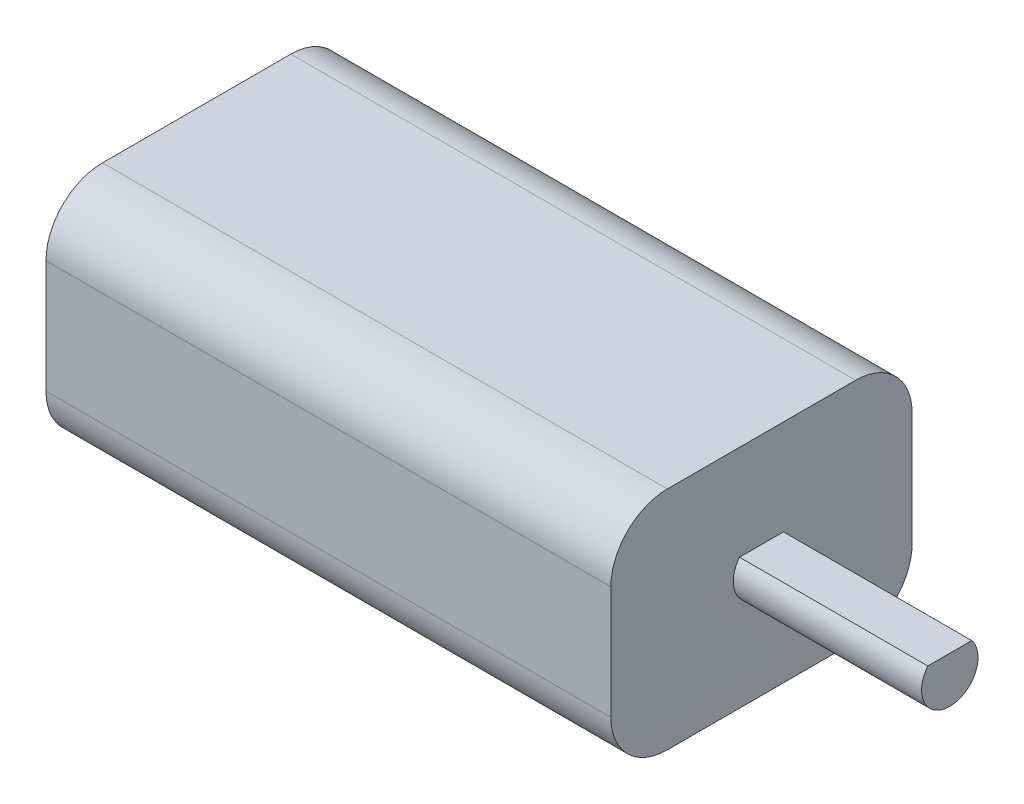
ISO-10303-21;
HEADER;
FILE_DESCRIPTION(('STEP AP214'),'2;1');
FILE_NAME('part.step','',(''),(''),'','','');
FILE_SCHEMA(('AUTOMOTIVE_DESIGN { 1 0 10303 214 1 1 1 1 }'));
ENDSEC;
DATA;
#1=APPLICATION_CONTEXT('core data for automotive mechanical design processes');
#2=APPLICATION_PROTOCOL_DEFINITION('international standard','automotive_design',2000,#1);
#3=PRODUCT_CONTEXT('',#1,'mechanical');
#4=PRODUCT('Part','Part','',(#3));
#5=PRODUCT_RELATED_PRODUCT_CATEGORY('part','',(#4));
#6=PRODUCT_DEFINITION_FORMATION('','',#4);
#7=PRODUCT_DEFINITION_CONTEXT('part definition',#1,'design');
#8=PRODUCT_DEFINITION('design','',#6,#7);
#9=PRODUCT_DEFINITION_SHAPE('','',#8);
#10=(LENGTH_UNIT() NAMED_UNIT(*) SI_UNIT(.MILLI.,.METRE.));
#11=(NAMED_UNIT(*) PLANE_ANGLE_UNIT() SI_UNIT($,.RADIAN.));
#12=(NAMED_UNIT(*) SI_UNIT($,.STERADIAN.) SOLID_ANGLE_UNIT());
#13=UNCERTAINTY_MEASURE_WITH_UNIT(LENGTH_MEASURE(1.E-05),#10,'distance_accuracy_value','');
#14=(GEOMETRIC_REPRESENTATION_CONTEXT(3) GLOBAL_UNCERTAINTY_ASSIGNED_CONTEXT((#13)) GLOBAL_UNIT_ASSIGNED_CONTEXT((#10,
#11,#12)) REPRESENTATION_CONTEXT('',''));
#15=CARTESIAN_POINT('',(0.,0.,0.));
#16=DIRECTION('',(0.,0.,1.));
#17=DIRECTION('',(1.,0.,0.));
#18=AXIS2_PLACEMENT_3D('',#15,#16,#17);
#19=CARTESIAN_POINT('',(15.,12.,8.));
#20=DIRECTION('',(-1.,0.,0.));
#21=DIRECTION('',(0.,0.,1.));
#22=AXIS2_PLACEMENT_3D('',#19,#20,#21);
#23=PLANE('',#22);
#24=DIRECTION('',(0.,-1.,0.));
#25=VECTOR('',#24,1.);
#26=CARTESIAN_POINT('',(15.,12.,8.));
#27=LINE('',#26,#25);
#28=CARTESIAN_POINT('',(15.,9.,8.));
#29=VERTEX_POINT('',#28);
#30=CARTESIAN_POINT('',(15.,3.,8.));
#31=VERTEX_POINT('',#30);
#32=EDGE_CURVE('E139',#29,#31,#27,.T.);
#33=ORIENTED_EDGE('',*,*,#32,.T.);
#34=CARTESIAN_POINT('',(15.,3.,5.));
#35=DIRECTION('',(-1.,0.,0.));
#36=DIRECTION('',(0.,0.,1.));
#37=AXIS2_PLACEMENT_3D('',#34,#35,#36);
#38=CIRCLE('',#37,3.);
#39=CARTESIAN_POINT('',(15.,0.,5.));
#40=VERTEX_POINT('',#39);
#41=EDGE_CURVE('E165',#31,#40,#38,.F.);
#42=ORIENTED_EDGE('',*,*,#41,.T.);
#43=DIRECTION('',(0.,0.,-1.));
#44=VECTOR('',#43,1.);
#45=CARTESIAN_POINT('',(15.,0.,8.));
#46=LINE('',#45,#44);
#47=CARTESIAN_POINT('',(15.,0.,-5.));
#48=VERTEX_POINT('',#47);
#49=EDGE_CURVE('E126',#40,#48,#46,.T.);
#50=ORIENTED_EDGE('',*,*,#49,.T.);
#51=CARTESIAN_POINT('',(15.,3.,-5.));
#52=DIRECTION('',(-1.,0.,0.));
#53=DIRECTION('',(0.,0.,1.));
#54=AXIS2_PLACEMENT_3D('',#51,#52,#53);
#55=CIRCLE('',#54,3.);
#56=CARTESIAN_POINT('',(15.,3.,-8.));
#57=VERTEX_POINT('',#56);
#58=EDGE_CURVE('E159',#48,#57,#55,.F.);
#59=ORIENTED_EDGE('',*,*,#58,.T.);
#60=DIRECTION('',(0.,-1.,0.));
#61=VECTOR('',#60,1.);
#62=CARTESIAN_POINT('',(15.,12.,-8.));
#63=LINE('',#62,#61);
#64=CARTESIAN_POINT('',(15.,9.,-8.));
#65=VERTEX_POINT('',#64);
#66=EDGE_CURVE('E151',#65,#57,#63,.T.);
#67=ORIENTED_EDGE('',*,*,#66,.F.);
#68=CARTESIAN_POINT('',(15.,9.,-5.));
#69=DIRECTION('',(-1.,0.,0.));
#70=DIRECTION('',(0.,0.,1.));
#71=AXIS2_PLACEMENT_3D('',#68,#69,#70);
#72=CIRCLE('',#71,3.);
#73=CARTESIAN_POINT('',(15.,12.,-5.));
#74=VERTEX_POINT('',#73);
#75=EDGE_CURVE('E161',#65,#74,#72,.F.);
#76=ORIENTED_EDGE('',*,*,#75,.T.);
#77=DIRECTION('',(0.,0.,-1.));
#78=VECTOR('',#77,1.);
#79=CARTESIAN_POINT('',(15.,12.,8.));
#80=LINE('',#79,#78);
#81=CARTESIAN_POINT('',(15.,12.,5.));
#82=VERTEX_POINT('',#81);
#83=EDGE_CURVE('E134',#82,#74,#80,.T.);
#84=ORIENTED_EDGE('',*,*,#83,.F.);
#85=CARTESIAN_POINT('',(15.,9.,5.));
#86=DIRECTION('',(-1.,0.,0.));
#87=DIRECTION('',(0.,0.,1.));
#88=AXIS2_PLACEMENT_3D('',#85,#86,#87);
#89=CIRCLE('',#88,3.);
#90=EDGE_CURVE('E163',#82,#29,#89,.F.);
#91=ORIENTED_EDGE('',*,*,#90,.T.);
#92=EDGE_LOOP('',(#33,#42,#50,#59,#67,#76,#84,#91));
#93=FACE_BOUND('',#92,.T.);
#94=CARTESIAN_POINT('',(15.,6.,0.));
#95=DIRECTION('',(1.,0.,0.));
#96=DIRECTION('',(0.,0.,-1.));
#97=AXIS2_PLACEMENT_3D('',#94,#95,#96);
#98=CIRCLE('',#97,1.5);
#99=CARTESIAN_POINT('',(15.,6.94293461893889,1.16656517366436));
#100=VERTEX_POINT('',#99);
#101=CARTESIAN_POINT('',(15.,6.94293461893889,-1.16656517366437));
#102=VERTEX_POINT('',#101);
#103=EDGE_CURVE('E125',#100,#102,#98,.T.);
#104=ORIENTED_EDGE('',*,*,#103,.F.);
#105=DIRECTION('',(0.,0.,1.));
#106=VECTOR('',#105,1.);
#107=CARTESIAN_POINT('',(15.,6.94293461893889,1.16656517366436));
#108=LINE('',#107,#106);
#109=EDGE_CURVE('E47',#102,#100,#108,.T.);
#110=ORIENTED_EDGE('',*,*,#109,.F.);
#111=EDGE_LOOP('',(#104,#110));
#112=FACE_BOUND('',#111,.T.);
#113=ADVANCED_FACE('F33',(#93,#112),#23,.F.);
#114=CARTESIAN_POINT('',(-15.,12.,-8.));
#115=DIRECTION('',(0.,0.,1.));
#116=DIRECTION('',(1.,0.,0.));
#117=AXIS2_PLACEMENT_3D('',#114,#115,#116);
#118=PLANE('',#117);
#119=DIRECTION('',(0.,-1.,0.));
#120=VECTOR('',#119,1.);
#121=CARTESIAN_POINT('',(-15.,12.,-8.));
#122=LINE('',#121,#120);
#123=CARTESIAN_POINT('',(-15.,9.,-8.));
#124=VERTEX_POINT('',#123);
#125=CARTESIAN_POINT('',(-15.,3.,-8.));
#126=VERTEX_POINT('',#125);
#127=EDGE_CURVE('E148',#124,#126,#122,.T.);
#128=ORIENTED_EDGE('',*,*,#127,.F.);
#129=DIRECTION('',(-1.,0.,0.));
#130=VECTOR('',#129,1.);
#131=CARTESIAN_POINT('',(-15.,9.,-8.));
#132=LINE('',#131,#130);
#133=EDGE_CURVE('E11',#124,#65,#132,.F.);
#134=ORIENTED_EDGE('',*,*,#133,.T.);
#135=ORIENTED_EDGE('',*,*,#66,.T.);
#136=DIRECTION('',(-1.,0.,0.));
#137=VECTOR('',#136,1.);
#138=CARTESIAN_POINT('',(-15.,3.,-8.));
#139=LINE('',#138,#137);
#140=EDGE_CURVE('E41',#57,#126,#139,.T.);
#141=ORIENTED_EDGE('',*,*,#140,.T.);
#142=EDGE_LOOP('',(#128,#134,#135,#141));
#143=FACE_BOUND('',#142,.T.);
#144=ADVANCED_FACE('F185',(#143),#118,.F.);
#145=CARTESIAN_POINT('',(-15.,12.,8.));
#146=DIRECTION('',(1.,0.,0.));
#147=DIRECTION('',(0.,0.,-1.));
#148=AXIS2_PLACEMENT_3D('',#145,#146,#147);
#149=PLANE('',#148);
#150=DIRECTION('',(0.,0.,1.));
#151=VECTOR('',#150,1.);
#152=CARTESIAN_POINT('',(-15.,0.,8.));
#153=LINE('',#152,#151);
#154=CARTESIAN_POINT('',(-15.,0.,-5.));
#155=VERTEX_POINT('',#154);
#156=CARTESIAN_POINT('',(-15.,0.,5.));
#157=VERTEX_POINT('',#156);
#158=EDGE_CURVE('E129',#155,#157,#153,.T.);
#159=ORIENTED_EDGE('',*,*,#158,.T.);
#160=CARTESIAN_POINT('',(-15.,3.,5.));
#161=DIRECTION('',(1.,0.,0.));
#162=DIRECTION('',(0.,0.,-1.));
#163=AXIS2_PLACEMENT_3D('',#160,#161,#162);
#164=CIRCLE('',#163,3.);
#165=CARTESIAN_POINT('',(-15.,3.,8.));
#166=VERTEX_POINT('',#165);
#167=EDGE_CURVE('E176',#157,#166,#164,.F.);
#168=ORIENTED_EDGE('',*,*,#167,.T.);
#169=DIRECTION('',(0.,-1.,0.));
#170=VECTOR('',#169,1.);
#171=CARTESIAN_POINT('',(-15.,12.,8.));
#172=LINE('',#171,#170);
#173=CARTESIAN_POINT('',(-15.,9.,8.));
#174=VERTEX_POINT('',#173);
#175=EDGE_CURVE('E145',#174,#166,#172,.T.);
#176=ORIENTED_EDGE('',*,*,#175,.F.);
#177=CARTESIAN_POINT('',(-15.,9.,5.));
#178=DIRECTION('',(1.,0.,0.));
#179=DIRECTION('',(0.,0.,-1.));
#180=AXIS2_PLACEMENT_3D('',#177,#178,#179);
#181=CIRCLE('',#180,3.);
#182=CARTESIAN_POINT('',(-15.,12.,5.));
#183=VERTEX_POINT('',#182);
#184=EDGE_CURVE('E174',#174,#183,#181,.F.);
#185=ORIENTED_EDGE('',*,*,#184,.T.);
#186=DIRECTION('',(0.,0.,1.));
#187=VECTOR('',#186,1.);
#188=CARTESIAN_POINT('',(-15.,12.,8.));
#189=LINE('',#188,#187);
#190=CARTESIAN_POINT('',(-15.,12.,-5.));
#191=VERTEX_POINT('',#190);
#192=EDGE_CURVE('E137',#191,#183,#189,.T.);
#193=ORIENTED_EDGE('',*,*,#192,.F.);
#194=CARTESIAN_POINT('',(-15.,9.,-5.));
#195=DIRECTION('',(1.,0.,0.));
#196=DIRECTION('',(0.,0.,-1.));
#197=AXIS2_PLACEMENT_3D('',#194,#195,#196);
#198=CIRCLE('',#197,3.);
#199=EDGE_CURVE('E172',#191,#124,#198,.F.);
#200=ORIENTED_EDGE('',*,*,#199,.T.);
#201=ORIENTED_EDGE('',*,*,#127,.T.);
#202=CARTESIAN_POINT('',(-15.,3.,-5.));
#203=DIRECTION('',(1.,0.,0.));
#204=DIRECTION('',(0.,0.,-1.));
#205=AXIS2_PLACEMENT_3D('',#202,#203,#204);
#206=CIRCLE('',#205,3.);
#207=EDGE_CURVE('E55',#126,#155,#206,.F.);
#208=ORIENTED_EDGE('',*,*,#207,.T.);
#209=EDGE_LOOP('',(#159,#168,#176,#185,#193,#200,#201,#208));
#210=FACE_BOUND('',#209,.T.);
#211=ADVANCED_FACE('F190',(#210),#149,.F.);
#212=CARTESIAN_POINT('',(-15.,12.,8.));
#213=DIRECTION('',(0.,0.,-1.));
#214=DIRECTION('',(-1.,0.,0.));
#215=AXIS2_PLACEMENT_3D('',#212,#213,#214);
#216=PLANE('',#215);
#217=ORIENTED_EDGE('',*,*,#175,.T.);
#218=DIRECTION('',(1.,0.,0.));
#219=VECTOR('',#218,1.);
#220=CARTESIAN_POINT('',(15.,3.,8.));
#221=LINE('',#220,#219);
#222=EDGE_CURVE('E156',#166,#31,#221,.T.);
#223=ORIENTED_EDGE('',*,*,#222,.T.);
#224=ORIENTED_EDGE('',*,*,#32,.F.);
#225=DIRECTION('',(1.,0.,0.));
#226=VECTOR('',#225,1.);
#227=CARTESIAN_POINT('',(-15.,9.,8.));
#228=LINE('',#227,#226);
#229=EDGE_CURVE('E154',#29,#174,#228,.F.);
#230=ORIENTED_EDGE('',*,*,#229,.T.);
#231=EDGE_LOOP('',(#217,#223,#224,#230));
#232=FACE_BOUND('',#231,.T.);
#233=ADVANCED_FACE('F213',(#232),#216,.F.);
#234=CARTESIAN_POINT('',(0.,12.,0.));
#235=DIRECTION('',(0.,-1.,0.));
#236=DIRECTION('',(0.,0.,-1.));
#237=AXIS2_PLACEMENT_3D('',#234,#235,#236);
#238=PLANE('',#237);
#239=ORIENTED_EDGE('',*,*,#192,.T.);
#240=DIRECTION('',(1.,0.,0.));
#241=VECTOR('',#240,1.);
#242=CARTESIAN_POINT('',(0.,12.,5.));
#243=LINE('',#242,#241);
#244=EDGE_CURVE('E181',#183,#82,#243,.T.);
#245=ORIENTED_EDGE('',*,*,#244,.T.);
#246=ORIENTED_EDGE('',*,*,#83,.T.);
#247=DIRECTION('',(-1.,0.,0.));
#248=VECTOR('',#247,1.);
#249=CARTESIAN_POINT('',(0.,12.,-5.));
#250=LINE('',#249,#248);
#251=EDGE_CURVE('E178',#74,#191,#250,.T.);
#252=ORIENTED_EDGE('',*,*,#251,.T.);
#253=EDGE_LOOP('',(#239,#245,#246,#252));
#254=FACE_BOUND('',#253,.T.);
#255=ADVANCED_FACE('F198',(#254),#238,.F.);
#256=CARTESIAN_POINT('',(0.,0.,0.));
#257=DIRECTION('',(0.,-1.,0.));
#258=DIRECTION('',(0.,0.,-1.));
#259=AXIS2_PLACEMENT_3D('',#256,#257,#258);
#260=PLANE('',#259);
#261=ORIENTED_EDGE('',*,*,#49,.F.);
#262=DIRECTION('',(1.,0.,0.));
#263=VECTOR('',#262,1.);
#264=CARTESIAN_POINT('',(-15.,0.,5.));
#265=LINE('',#264,#263);
#266=EDGE_CURVE('E169',#40,#157,#265,.F.);
#267=ORIENTED_EDGE('',*,*,#266,.T.);
#268=ORIENTED_EDGE('',*,*,#158,.F.);
#269=DIRECTION('',(-1.,0.,0.));
#270=VECTOR('',#269,1.);
#271=CARTESIAN_POINT('',(15.,0.,-5.));
#272=LINE('',#271,#270);
#273=EDGE_CURVE('E167',#155,#48,#272,.F.);
#274=ORIENTED_EDGE('',*,*,#273,.T.);
#275=EDGE_LOOP('',(#261,#267,#268,#274));
#276=FACE_BOUND('',#275,.T.);
#277=ADVANCED_FACE('F205',(#276),#260,.T.);
#278=CARTESIAN_POINT('',(-15.,3.,5.));
#279=DIRECTION('',(-1.,0.,0.));
#280=DIRECTION('',(0.,0.,1.));
#281=AXIS2_PLACEMENT_3D('',#278,#279,#280);
#282=CYLINDRICAL_SURFACE('',#281,3.);
#283=ORIENTED_EDGE('',*,*,#167,.F.);
#284=ORIENTED_EDGE('',*,*,#266,.F.);
#285=ORIENTED_EDGE('',*,*,#41,.F.);
#286=ORIENTED_EDGE('',*,*,#222,.F.);
#287=EDGE_LOOP('',(#283,#284,#285,#286));
#288=FACE_BOUND('',#287,.T.);
#289=ADVANCED_FACE('F211',(#288),#282,.T.);
#290=CARTESIAN_POINT('',(0.,9.,5.));
#291=DIRECTION('',(1.,0.,0.));
#292=DIRECTION('',(0.,0.,-1.));
#293=AXIS2_PLACEMENT_3D('',#290,#291,#292);
#294=CYLINDRICAL_SURFACE('',#293,3.);
#295=ORIENTED_EDGE('',*,*,#184,.F.);
#296=ORIENTED_EDGE('',*,*,#229,.F.);
#297=ORIENTED_EDGE('',*,*,#90,.F.);
#298=ORIENTED_EDGE('',*,*,#244,.F.);
#299=EDGE_LOOP('',(#295,#296,#297,#298));
#300=FACE_BOUND('',#299,.T.);
#301=ADVANCED_FACE('F217',(#300),#294,.T.);
#302=CARTESIAN_POINT('',(0.,9.,-5.));
#303=DIRECTION('',(-1.,0.,0.));
#304=DIRECTION('',(0.,0.,1.));
#305=AXIS2_PLACEMENT_3D('',#302,#303,#304);
#306=CYLINDRICAL_SURFACE('',#305,3.);
#307=ORIENTED_EDGE('',*,*,#75,.F.);
#308=ORIENTED_EDGE('',*,*,#133,.F.);
#309=ORIENTED_EDGE('',*,*,#199,.F.);
#310=ORIENTED_EDGE('',*,*,#251,.F.);
#311=EDGE_LOOP('',(#307,#308,#309,#310));
#312=FACE_BOUND('',#311,.T.);
#313=ADVANCED_FACE('F196',(#312),#306,.T.);
#314=CARTESIAN_POINT('',(-15.,3.,-5.));
#315=DIRECTION('',(1.,0.,0.));
#316=DIRECTION('',(0.,0.,-1.));
#317=AXIS2_PLACEMENT_3D('',#314,#315,#316);
#318=CYLINDRICAL_SURFACE('',#317,3.);
#319=ORIENTED_EDGE('',*,*,#58,.F.);
#320=ORIENTED_EDGE('',*,*,#273,.F.);
#321=ORIENTED_EDGE('',*,*,#207,.F.);
#322=ORIENTED_EDGE('',*,*,#140,.F.);
#323=EDGE_LOOP('',(#319,#320,#321,#322));
#324=FACE_BOUND('',#323,.T.);
#325=ADVANCED_FACE('F35',(#324),#318,.T.);
#326=CARTESIAN_POINT('',(25.,6.,0.));
#327=DIRECTION('',(-1.,0.,0.));
#328=DIRECTION('',(0.,0.,1.));
#329=AXIS2_PLACEMENT_3D('',#326,#327,#328);
#330=CYLINDRICAL_SURFACE('',#329,1.5);
#331=ORIENTED_EDGE('',*,*,#103,.T.);
#332=DIRECTION('',(-1.,0.,0.));
#333=VECTOR('',#332,1.);
#334=CARTESIAN_POINT('',(25.,6.94293461893889,-1.16656517366436));
#335=LINE('',#334,#333);
#336=CARTESIAN_POINT('',(25.,6.94293461893889,-1.16656517366436));
#337=VERTEX_POINT('',#336);
#338=EDGE_CURVE('E113',#337,#102,#335,.T.);
#339=ORIENTED_EDGE('',*,*,#338,.F.);
#340=CARTESIAN_POINT('',(25.,6.,0.));
#341=DIRECTION('',(1.,0.,0.));
#342=DIRECTION('',(0.,0.,-1.));
#343=AXIS2_PLACEMENT_3D('',#340,#341,#342);
#344=CIRCLE('',#343,1.5);
#345=CARTESIAN_POINT('',(25.,6.94293461893889,1.16656517366436));
#346=VERTEX_POINT('',#345);
#347=EDGE_CURVE('E119',#346,#337,#344,.T.);
#348=ORIENTED_EDGE('',*,*,#347,.F.);
#349=DIRECTION('',(-1.,0.,0.));
#350=VECTOR('',#349,1.);
#351=CARTESIAN_POINT('',(25.,6.94293461893889,1.16656517366436));
#352=LINE('',#351,#350);
#353=EDGE_CURVE('E116',#346,#100,#352,.T.);
#354=ORIENTED_EDGE('',*,*,#353,.T.);
#355=EDGE_LOOP('',(#331,#339,#348,#354));
#356=FACE_BOUND('',#355,.T.);
#357=ADVANCED_FACE('F124',(#356),#330,.T.);
#358=CARTESIAN_POINT('',(25.,6.94293461893889,1.16656517366436));
#359=DIRECTION('',(0.,-1.,0.));
#360=DIRECTION('',(0.,0.,-1.));
#361=AXIS2_PLACEMENT_3D('',#358,#359,#360);
#362=PLANE('',#361);
#363=ORIENTED_EDGE('',*,*,#109,.T.);
#364=ORIENTED_EDGE('',*,*,#353,.F.);
#365=DIRECTION('',(0.,0.,1.));
#366=VECTOR('',#365,1.);
#367=CARTESIAN_POINT('',(25.,6.94293461893889,1.16656517366436));
#368=LINE('',#367,#366);
#369=EDGE_CURVE('E109',#337,#346,#368,.T.);
#370=ORIENTED_EDGE('',*,*,#369,.F.);
#371=ORIENTED_EDGE('',*,*,#338,.T.);
#372=EDGE_LOOP('',(#363,#364,#370,#371));
#373=FACE_BOUND('',#372,.T.);
#374=ADVANCED_FACE('F111',(#373),#362,.F.);
#375=CARTESIAN_POINT('',(25.,6.,0.));
#376=DIRECTION('',(1.,0.,0.));
#377=DIRECTION('',(0.,0.,-1.));
#378=AXIS2_PLACEMENT_3D('',#375,#376,#377);
#379=PLANE('',#378);
#380=ORIENTED_EDGE('',*,*,#347,.T.);
#381=ORIENTED_EDGE('',*,*,#369,.T.);
#382=EDGE_LOOP('',(#380,#381));
#383=FACE_BOUND('',#382,.T.);
#384=ADVANCED_FACE('F121',(#383),#379,.T.);
#385=CLOSED_SHELL('',(#113,#144,#211,#233,#255,#277,#289,#301,#313,#325,#357,#374,#384));
#386=MANIFOLD_SOLID_BREP('B2',#385);
#387=ADVANCED_BREP_SHAPE_REPRESENTATION('',(#18,#386),#14);
#388=SHAPE_DEFINITION_REPRESENTATION(#9,#387);
ENDSEC;
END-ISO-10303-21;
